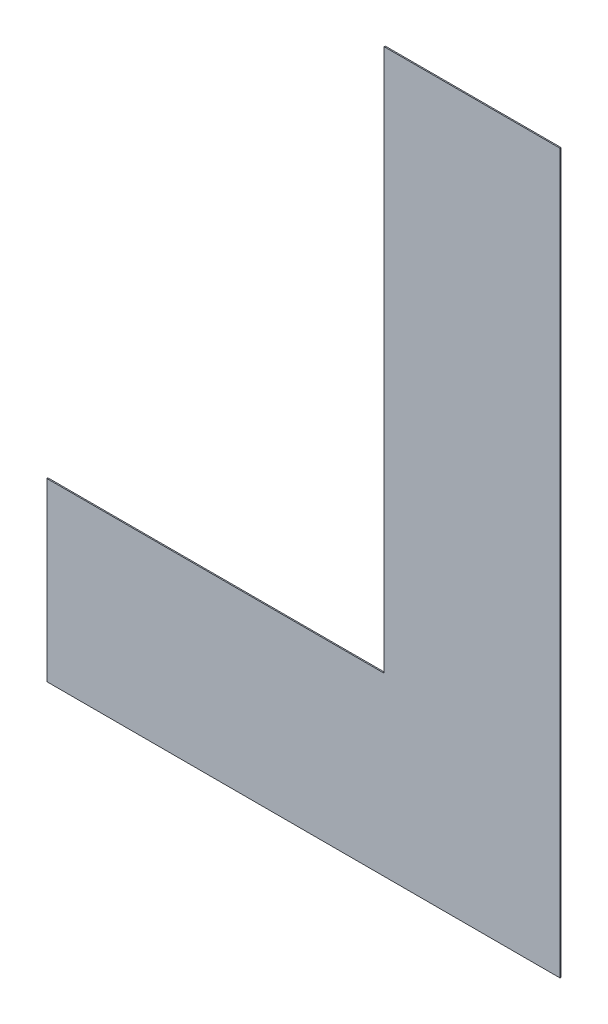
ISO-10303-21;
HEADER;
FILE_DESCRIPTION(('STEP AP214'),'2;1');
FILE_NAME('part.step','',(''),(''),'','','');
FILE_SCHEMA(('AUTOMOTIVE_DESIGN { 1 0 10303 214 1 1 1 1 }'));
ENDSEC;
DATA;
#1=APPLICATION_CONTEXT('core data for automotive mechanical design processes');
#2=APPLICATION_PROTOCOL_DEFINITION('international standard','automotive_design',2000,#1);
#3=PRODUCT_CONTEXT('',#1,'mechanical');
#4=PRODUCT('Part','Part','',(#3));
#5=PRODUCT_RELATED_PRODUCT_CATEGORY('part','',(#4));
#6=PRODUCT_DEFINITION_FORMATION('','',#4);
#7=PRODUCT_DEFINITION_CONTEXT('part definition',#1,'design');
#8=PRODUCT_DEFINITION('design','',#6,#7);
#9=PRODUCT_DEFINITION_SHAPE('','',#8);
#10=(LENGTH_UNIT() NAMED_UNIT(*) SI_UNIT(.MILLI.,.METRE.));
#11=(NAMED_UNIT(*) PLANE_ANGLE_UNIT() SI_UNIT($,.RADIAN.));
#12=(NAMED_UNIT(*) SI_UNIT($,.STERADIAN.) SOLID_ANGLE_UNIT());
#13=UNCERTAINTY_MEASURE_WITH_UNIT(LENGTH_MEASURE(1.E-05),#10,'distance_accuracy_value','');
#14=(GEOMETRIC_REPRESENTATION_CONTEXT(3) GLOBAL_UNCERTAINTY_ASSIGNED_CONTEXT((#13)) GLOBAL_UNIT_ASSIGNED_CONTEXT((#10,
#11,#12)) REPRESENTATION_CONTEXT('',''));
#15=CARTESIAN_POINT('',(0.,0.,0.));
#16=DIRECTION('',(0.,0.,1.));
#17=DIRECTION('',(1.,0.,0.));
#18=AXIS2_PLACEMENT_3D('',#15,#16,#17);
#19=CARTESIAN_POINT('',(-22.225,81.915,1.5875));
#20=DIRECTION('',(0.,0.,1.));
#21=DIRECTION('',(1.,0.,0.));
#22=AXIS2_PLACEMENT_3D('',#19,#20,#21);
#23=PLANE('',#22);
#24=DIRECTION('',(1.,0.,0.));
#25=VECTOR('',#24,1.);
#26=CARTESIAN_POINT('',(0.,113.03,1.5875));
#27=LINE('',#26,#25);
#28=CARTESIAN_POINT('',(0.,113.03,1.5875));
#29=VERTEX_POINT('',#28);
#30=CARTESIAN_POINT('',(-15.24,113.03,1.5875));
#31=VERTEX_POINT('',#30);
#32=EDGE_CURVE('E103',#29,#31,#27,.F.);
#33=ORIENTED_EDGE('',*,*,#32,.F.);
#34=DIRECTION('',(0.,1.,0.));
#35=VECTOR('',#34,1.);
#36=CARTESIAN_POINT('',(0.,50.8,1.5875));
#37=LINE('',#36,#35);
#38=CARTESIAN_POINT('',(0.,50.8,1.5875));
#39=VERTEX_POINT('',#38);
#40=EDGE_CURVE('E98',#39,#29,#37,.T.);
#41=ORIENTED_EDGE('',*,*,#40,.F.);
#42=DIRECTION('',(1.,0.,0.));
#43=VECTOR('',#42,1.);
#44=CARTESIAN_POINT('',(-44.45,50.8,1.5875));
#45=LINE('',#44,#43);
#46=CARTESIAN_POINT('',(-44.45,50.8,1.5875));
#47=VERTEX_POINT('',#46);
#48=EDGE_CURVE('E92',#47,#39,#45,.T.);
#49=ORIENTED_EDGE('',*,*,#48,.F.);
#50=DIRECTION('',(0.,-1.,0.));
#51=VECTOR('',#50,1.);
#52=CARTESIAN_POINT('',(-44.45,66.04,1.5875));
#53=LINE('',#52,#51);
#54=CARTESIAN_POINT('',(-44.45,66.04,1.5875));
#55=VERTEX_POINT('',#54);
#56=EDGE_CURVE('E68',#55,#47,#53,.T.);
#57=ORIENTED_EDGE('',*,*,#56,.F.);
#58=DIRECTION('',(1.,0.,0.));
#59=VECTOR('',#58,1.);
#60=CARTESIAN_POINT('',(-15.24,66.04,1.5875));
#61=LINE('',#60,#59);
#62=CARTESIAN_POINT('',(-15.24,66.04,1.5875));
#63=VERTEX_POINT('',#62);
#64=EDGE_CURVE('E70',#63,#55,#61,.F.);
#65=ORIENTED_EDGE('',*,*,#64,.F.);
#66=DIRECTION('',(0.,-1.,0.));
#67=VECTOR('',#66,1.);
#68=CARTESIAN_POINT('',(-15.24,113.03,1.5875));
#69=LINE('',#68,#67);
#70=EDGE_CURVE('E20',#31,#63,#69,.T.);
#71=ORIENTED_EDGE('',*,*,#70,.F.);
#72=EDGE_LOOP('',(#33,#41,#49,#57,#65,#71));
#73=FACE_BOUND('',#72,.T.);
#74=ADVANCED_FACE('F17',(#73),#23,.F.);
#75=CARTESIAN_POINT('',(-15.24,113.03,1.5875));
#76=DIRECTION('',(-1.,0.,0.));
#77=DIRECTION('',(0.,-1.,0.));
#78=AXIS2_PLACEMENT_3D('',#75,#76,#77);
#79=PLANE('',#78);
#80=DIRECTION('',(0.,1.,0.));
#81=VECTOR('',#80,1.);
#82=CARTESIAN_POINT('',(-15.24,81.915,1.6875));
#83=LINE('',#82,#81);
#84=CARTESIAN_POINT('',(-15.24,113.03,1.6875));
#85=VERTEX_POINT('',#84);
#86=CARTESIAN_POINT('',(-15.24,66.04,1.6875));
#87=VERTEX_POINT('',#86);
#88=EDGE_CURVE('E107',#85,#87,#83,.F.);
#89=ORIENTED_EDGE('',*,*,#88,.F.);
#90=DIRECTION('',(0.,0.,1.));
#91=VECTOR('',#90,1.);
#92=CARTESIAN_POINT('',(-15.24,113.03,1.5875));
#93=LINE('',#92,#91);
#94=EDGE_CURVE('E81',#31,#85,#93,.T.);
#95=ORIENTED_EDGE('',*,*,#94,.F.);
#96=ORIENTED_EDGE('',*,*,#70,.T.);
#97=DIRECTION('',(0.,0.,1.));
#98=VECTOR('',#97,1.);
#99=CARTESIAN_POINT('',(-15.24,66.04,1.5875));
#100=LINE('',#99,#98);
#101=EDGE_CURVE('E76',#87,#63,#100,.F.);
#102=ORIENTED_EDGE('',*,*,#101,.F.);
#103=EDGE_LOOP('',(#89,#95,#96,#102));
#104=FACE_BOUND('',#103,.T.);
#105=ADVANCED_FACE('F78',(#104),#79,.T.);
#106=CARTESIAN_POINT('',(-15.24,66.04,1.5875));
#107=DIRECTION('',(0.,1.,0.));
#108=DIRECTION('',(0.,0.,1.));
#109=AXIS2_PLACEMENT_3D('',#106,#107,#108);
#110=PLANE('',#109);
#111=DIRECTION('',(1.,0.,0.));
#112=VECTOR('',#111,1.);
#113=CARTESIAN_POINT('',(-22.225,66.04,1.6875));
#114=LINE('',#113,#112);
#115=CARTESIAN_POINT('',(-44.45,66.04,1.6875));
#116=VERTEX_POINT('',#115);
#117=EDGE_CURVE('E85',#87,#116,#114,.F.);
#118=ORIENTED_EDGE('',*,*,#117,.F.);
#119=ORIENTED_EDGE('',*,*,#101,.T.);
#120=ORIENTED_EDGE('',*,*,#64,.T.);
#121=DIRECTION('',(0.,0.,1.));
#122=VECTOR('',#121,1.);
#123=CARTESIAN_POINT('',(-44.45,66.04,1.5875));
#124=LINE('',#123,#122);
#125=EDGE_CURVE('E88',#116,#55,#124,.F.);
#126=ORIENTED_EDGE('',*,*,#125,.F.);
#127=EDGE_LOOP('',(#118,#119,#120,#126));
#128=FACE_BOUND('',#127,.T.);
#129=ADVANCED_FACE('F83',(#128),#110,.T.);
#130=CARTESIAN_POINT('',(-44.45,66.04,1.5875));
#131=DIRECTION('',(-1.,0.,0.));
#132=DIRECTION('',(0.,-1.,0.));
#133=AXIS2_PLACEMENT_3D('',#130,#131,#132);
#134=PLANE('',#133);
#135=DIRECTION('',(0.,1.,0.));
#136=VECTOR('',#135,1.);
#137=CARTESIAN_POINT('',(-44.45,81.915,1.6875));
#138=LINE('',#137,#136);
#139=CARTESIAN_POINT('',(-44.45,50.8,1.6875));
#140=VERTEX_POINT('',#139);
#141=EDGE_CURVE('E110',#116,#140,#138,.F.);
#142=ORIENTED_EDGE('',*,*,#141,.F.);
#143=ORIENTED_EDGE('',*,*,#125,.T.);
#144=ORIENTED_EDGE('',*,*,#56,.T.);
#145=DIRECTION('',(0.,0.,-1.));
#146=VECTOR('',#145,1.);
#147=CARTESIAN_POINT('',(-44.45,50.8,1.5875));
#148=LINE('',#147,#146);
#149=EDGE_CURVE('E95',#140,#47,#148,.T.);
#150=ORIENTED_EDGE('',*,*,#149,.F.);
#151=EDGE_LOOP('',(#142,#143,#144,#150));
#152=FACE_BOUND('',#151,.T.);
#153=ADVANCED_FACE('F125',(#152),#134,.T.);
#154=CARTESIAN_POINT('',(-44.45,50.8,1.5875));
#155=DIRECTION('',(0.,-1.,0.));
#156=DIRECTION('',(0.,0.,-1.));
#157=AXIS2_PLACEMENT_3D('',#154,#155,#156);
#158=PLANE('',#157);
#159=DIRECTION('',(1.,0.,0.));
#160=VECTOR('',#159,1.);
#161=CARTESIAN_POINT('',(-22.225,50.8,1.6875));
#162=LINE('',#161,#160);
#163=CARTESIAN_POINT('',(0.,50.8,1.6875));
#164=VERTEX_POINT('',#163);
#165=EDGE_CURVE('E113',#140,#164,#162,.T.);
#166=ORIENTED_EDGE('',*,*,#165,.F.);
#167=ORIENTED_EDGE('',*,*,#149,.T.);
#168=ORIENTED_EDGE('',*,*,#48,.T.);
#169=DIRECTION('',(0.,0.,1.));
#170=VECTOR('',#169,1.);
#171=CARTESIAN_POINT('',(0.,50.8,1.5875));
#172=LINE('',#171,#170);
#173=EDGE_CURVE('E100',#164,#39,#172,.F.);
#174=ORIENTED_EDGE('',*,*,#173,.F.);
#175=EDGE_LOOP('',(#166,#167,#168,#174));
#176=FACE_BOUND('',#175,.T.);
#177=ADVANCED_FACE('F122',(#176),#158,.T.);
#178=CARTESIAN_POINT('',(0.,50.8,1.5875));
#179=DIRECTION('',(1.,0.,0.));
#180=DIRECTION('',(0.,1.,0.));
#181=AXIS2_PLACEMENT_3D('',#178,#179,#180);
#182=PLANE('',#181);
#183=DIRECTION('',(0.,1.,0.));
#184=VECTOR('',#183,1.);
#185=CARTESIAN_POINT('',(0.,81.915,1.6875));
#186=LINE('',#185,#184);
#187=CARTESIAN_POINT('',(0.,113.03,1.6875));
#188=VERTEX_POINT('',#187);
#189=EDGE_CURVE('E26',#164,#188,#186,.T.);
#190=ORIENTED_EDGE('',*,*,#189,.F.);
#191=ORIENTED_EDGE('',*,*,#173,.T.);
#192=ORIENTED_EDGE('',*,*,#40,.T.);
#193=DIRECTION('',(0.,0.,1.));
#194=VECTOR('',#193,1.);
#195=CARTESIAN_POINT('',(0.,113.03,1.5875));
#196=LINE('',#195,#194);
#197=EDGE_CURVE('E35',#188,#29,#196,.F.);
#198=ORIENTED_EDGE('',*,*,#197,.F.);
#199=EDGE_LOOP('',(#190,#191,#192,#198));
#200=FACE_BOUND('',#199,.T.);
#201=ADVANCED_FACE('F120',(#200),#182,.T.);
#202=CARTESIAN_POINT('',(0.,113.03,1.5875));
#203=DIRECTION('',(0.,1.,0.));
#204=DIRECTION('',(0.,0.,1.));
#205=AXIS2_PLACEMENT_3D('',#202,#203,#204);
#206=PLANE('',#205);
#207=DIRECTION('',(1.,0.,0.));
#208=VECTOR('',#207,1.);
#209=CARTESIAN_POINT('',(-22.225,113.03,1.6875));
#210=LINE('',#209,#208);
#211=EDGE_CURVE('E11',#188,#85,#210,.F.);
#212=ORIENTED_EDGE('',*,*,#211,.F.);
#213=ORIENTED_EDGE('',*,*,#197,.T.);
#214=ORIENTED_EDGE('',*,*,#32,.T.);
#215=ORIENTED_EDGE('',*,*,#94,.T.);
#216=EDGE_LOOP('',(#212,#213,#214,#215));
#217=FACE_BOUND('',#216,.T.);
#218=ADVANCED_FACE('F127',(#217),#206,.T.);
#219=CARTESIAN_POINT('',(-22.225,81.915,1.6875));
#220=DIRECTION('',(0.,0.,1.));
#221=DIRECTION('',(1.,0.,0.));
#222=AXIS2_PLACEMENT_3D('',#219,#220,#221);
#223=PLANE('',#222);
#224=ORIENTED_EDGE('',*,*,#189,.T.);
#225=ORIENTED_EDGE('',*,*,#211,.T.);
#226=ORIENTED_EDGE('',*,*,#88,.T.);
#227=ORIENTED_EDGE('',*,*,#117,.T.);
#228=ORIENTED_EDGE('',*,*,#141,.T.);
#229=ORIENTED_EDGE('',*,*,#165,.T.);
#230=EDGE_LOOP('',(#224,#225,#226,#227,#228,#229));
#231=FACE_BOUND('',#230,.T.);
#232=ADVANCED_FACE('F118',(#231),#223,.T.);
#233=CLOSED_SHELL('',(#74,#105,#129,#153,#177,#201,#218,#232));
#234=MANIFOLD_SOLID_BREP('B1',#233);
#235=ADVANCED_BREP_SHAPE_REPRESENTATION('',(#18,#234),#14);
#236=SHAPE_DEFINITION_REPRESENTATION(#9,#235);
ENDSEC;
END-ISO-10303-21;
